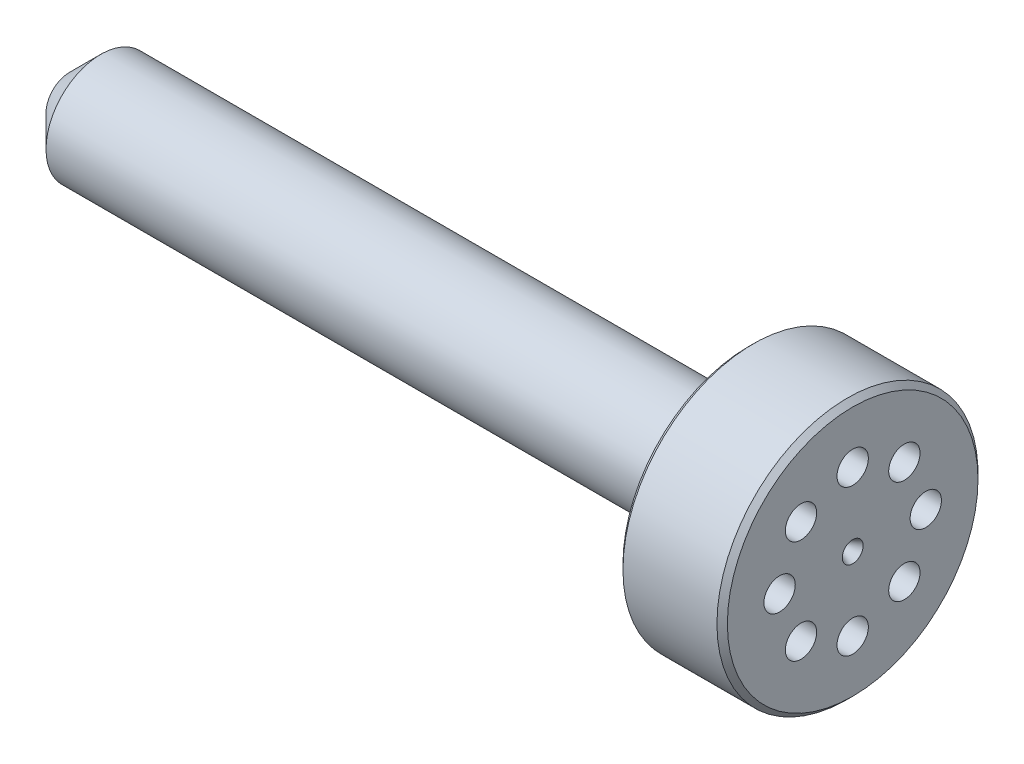
ISO-10303-21;
HEADER;
FILE_DESCRIPTION(('STEP AP214'),'2;1');
FILE_NAME('part.step','',(''),(''),'','','');
FILE_SCHEMA(('AUTOMOTIVE_DESIGN { 1 0 10303 214 1 1 1 1 }'));
ENDSEC;
DATA;
#1=APPLICATION_CONTEXT('core data for automotive mechanical design processes');
#2=APPLICATION_PROTOCOL_DEFINITION('international standard','automotive_design',2000,#1);
#3=PRODUCT_CONTEXT('',#1,'mechanical');
#4=PRODUCT('Part','Part','',(#3));
#5=PRODUCT_RELATED_PRODUCT_CATEGORY('part','',(#4));
#6=PRODUCT_DEFINITION_FORMATION('','',#4);
#7=PRODUCT_DEFINITION_CONTEXT('part definition',#1,'design');
#8=PRODUCT_DEFINITION('design','',#6,#7);
#9=PRODUCT_DEFINITION_SHAPE('','',#8);
#10=(LENGTH_UNIT() NAMED_UNIT(*) SI_UNIT(.MILLI.,.METRE.));
#11=(NAMED_UNIT(*) PLANE_ANGLE_UNIT() SI_UNIT($,.RADIAN.));
#12=(NAMED_UNIT(*) SI_UNIT($,.STERADIAN.) SOLID_ANGLE_UNIT());
#13=UNCERTAINTY_MEASURE_WITH_UNIT(LENGTH_MEASURE(1.E-05),#10,'distance_accuracy_value','');
#14=(GEOMETRIC_REPRESENTATION_CONTEXT(3) GLOBAL_UNCERTAINTY_ASSIGNED_CONTEXT((#13)) GLOBAL_UNIT_ASSIGNED_CONTEXT((#10,
#11,#12)) REPRESENTATION_CONTEXT('',''));
#15=CARTESIAN_POINT('',(0.,0.,0.));
#16=DIRECTION('',(0.,0.,1.));
#17=DIRECTION('',(1.,0.,0.));
#18=AXIS2_PLACEMENT_3D('',#15,#16,#17);
#19=CARTESIAN_POINT('',(-34.,0.,0.));
#20=DIRECTION('',(-1.,0.,0.));
#21=DIRECTION('',(0.,0.,1.));
#22=AXIS2_PLACEMENT_3D('',#19,#20,#21);
#23=CONICAL_SURFACE('',#22,1.,0.463647609000804);
#24=CARTESIAN_POINT('',(-32.,0.,0.));
#25=VERTEX_POINT('',#24);
#26=VERTEX_LOOP('',#25);
#27=FACE_BOUND('',#26,.T.);
#28=CARTESIAN_POINT('',(-34.,0.,0.));
#29=DIRECTION('',(-1.,0.,0.));
#30=DIRECTION('',(0.,0.,1.));
#31=AXIS2_PLACEMENT_3D('',#28,#29,#30);
#32=CIRCLE('',#31,1.);
#33=CARTESIAN_POINT('',(-34.,0.,1.));
#34=VERTEX_POINT('',#33);
#35=EDGE_CURVE('E56',#34,#34,#32,.T.);
#36=ORIENTED_EDGE('',*,*,#35,.T.);
#37=EDGE_LOOP('',(#36));
#38=FACE_BOUND('',#37,.T.);
#39=ADVANCED_FACE('F35',(#27,#38),#23,.F.);
#40=CARTESIAN_POINT('',(-34.,0.,-0.999999999999996));
#41=DIRECTION('',(1.,0.,0.));
#42=DIRECTION('',(0.,0.,-1.));
#43=AXIS2_PLACEMENT_3D('',#40,#41,#42);
#44=PLANE('',#43);
#45=ORIENTED_EDGE('',*,*,#35,.F.);
#46=EDGE_LOOP('',(#45));
#47=FACE_BOUND('',#46,.T.);
#48=CARTESIAN_POINT('',(-34.,0.,0.));
#49=DIRECTION('',(-1.,0.,0.));
#50=DIRECTION('',(0.,0.,1.));
#51=AXIS2_PLACEMENT_3D('',#48,#49,#50);
#52=CIRCLE('',#51,2.25);
#53=CARTESIAN_POINT('',(-34.,0.,2.25));
#54=VERTEX_POINT('',#53);
#55=EDGE_CURVE('E59',#54,#54,#52,.T.);
#56=ORIENTED_EDGE('',*,*,#55,.T.);
#57=EDGE_LOOP('',(#56));
#58=FACE_BOUND('',#57,.T.);
#59=ADVANCED_FACE('F52',(#47,#58),#44,.F.);
#60=CARTESIAN_POINT('',(-31.,0.,0.));
#61=DIRECTION('',(1.,0.,0.));
#62=DIRECTION('',(0.,0.,-1.));
#63=AXIS2_PLACEMENT_3D('',#60,#61,#62);
#64=CONICAL_SURFACE('',#63,5.25,0.785398163397449);
#65=ORIENTED_EDGE('',*,*,#55,.F.);
#66=EDGE_LOOP('',(#65));
#67=FACE_BOUND('',#66,.T.);
#68=CARTESIAN_POINT('',(-31.,0.,0.));
#69=DIRECTION('',(-1.,0.,0.));
#70=DIRECTION('',(0.,0.,1.));
#71=AXIS2_PLACEMENT_3D('',#68,#69,#70);
#72=CIRCLE('',#71,5.25);
#73=CARTESIAN_POINT('',(-31.,0.,5.25000000000001));
#74=VERTEX_POINT('',#73);
#75=EDGE_CURVE('E65',#74,#74,#72,.T.);
#76=ORIENTED_EDGE('',*,*,#75,.T.);
#77=EDGE_LOOP('',(#76));
#78=FACE_BOUND('',#77,.T.);
#79=ADVANCED_FACE('F186',(#67,#78),#64,.T.);
#80=CARTESIAN_POINT('',(-32.,0.,0.));
#81=DIRECTION('',(-1.,0.,0.));
#82=DIRECTION('',(0.,0.,1.));
#83=AXIS2_PLACEMENT_3D('',#80,#81,#82);
#84=CYLINDRICAL_SURFACE('',#83,5.25);
#85=ORIENTED_EDGE('',*,*,#75,.F.);
#86=EDGE_LOOP('',(#85));
#87=FACE_BOUND('',#86,.T.);
#88=CARTESIAN_POINT('',(31.,0.,0.));
#89=DIRECTION('',(-1.,0.,0.));
#90=DIRECTION('',(0.,0.,1.));
#91=AXIS2_PLACEMENT_3D('',#88,#89,#90);
#92=CIRCLE('',#91,5.25000000000001);
#93=CARTESIAN_POINT('',(31.,0.,5.25000000000002));
#94=VERTEX_POINT('',#93);
#95=EDGE_CURVE('E101',#94,#94,#92,.T.);
#96=ORIENTED_EDGE('',*,*,#95,.T.);
#97=EDGE_LOOP('',(#96));
#98=FACE_BOUND('',#97,.T.);
#99=ADVANCED_FACE('F96',(#87,#98),#84,.T.);
#100=CARTESIAN_POINT('',(31.,0.,-5.25));
#101=DIRECTION('',(1.,0.,0.));
#102=DIRECTION('',(0.,0.,-1.));
#103=AXIS2_PLACEMENT_3D('',#100,#101,#102);
#104=PLANE('',#103);
#105=CARTESIAN_POINT('',(31.,4.94974746830583,4.94974746830584));
#106=DIRECTION('',(1.,0.,0.));
#107=DIRECTION('',(0.,0.,-1.));
#108=AXIS2_PLACEMENT_3D('',#105,#106,#107);
#109=CIRCLE('',#108,1.5);
#110=CARTESIAN_POINT('',(31.,4.94974746830583,3.44974746830584));
#111=VERTEX_POINT('',#110);
#112=EDGE_CURVE('E107',#111,#111,#109,.T.);
#113=ORIENTED_EDGE('',*,*,#112,.T.);
#114=EDGE_LOOP('',(#113));
#115=FACE_BOUND('',#114,.T.);
#116=CARTESIAN_POINT('',(31.,0.,7.00000000000001));
#117=DIRECTION('',(1.,0.,0.));
#118=DIRECTION('',(0.,0.,-1.));
#119=AXIS2_PLACEMENT_3D('',#116,#117,#118);
#120=CIRCLE('',#119,1.50000000000009);
#121=CARTESIAN_POINT('',(31.,0.,5.49999999999992));
#122=VERTEX_POINT('',#121);
#123=EDGE_CURVE('E112',#122,#122,#120,.T.);
#124=ORIENTED_EDGE('',*,*,#123,.T.);
#125=EDGE_LOOP('',(#124));
#126=FACE_BOUND('',#125,.T.);
#127=CARTESIAN_POINT('',(31.,-4.94974746830583,4.94974746830584));
#128=DIRECTION('',(1.,0.,0.));
#129=DIRECTION('',(0.,0.,-1.));
#130=AXIS2_PLACEMENT_3D('',#127,#128,#129);
#131=CIRCLE('',#130,1.5);
#132=CARTESIAN_POINT('',(31.,-4.94974746830583,3.44974746830584));
#133=VERTEX_POINT('',#132);
#134=EDGE_CURVE('E115',#133,#133,#131,.T.);
#135=ORIENTED_EDGE('',*,*,#134,.T.);
#136=EDGE_LOOP('',(#135));
#137=FACE_BOUND('',#136,.T.);
#138=CARTESIAN_POINT('',(31.,-7.,0.));
#139=DIRECTION('',(1.,0.,0.));
#140=DIRECTION('',(0.,0.,-1.));
#141=AXIS2_PLACEMENT_3D('',#138,#139,#140);
#142=CIRCLE('',#141,1.5);
#143=CARTESIAN_POINT('',(31.,-7.,-1.49999999999999));
#144=VERTEX_POINT('',#143);
#145=EDGE_CURVE('E118',#144,#144,#142,.T.);
#146=ORIENTED_EDGE('',*,*,#145,.T.);
#147=EDGE_LOOP('',(#146));
#148=FACE_BOUND('',#147,.T.);
#149=CARTESIAN_POINT('',(31.,-4.94974746830583,-4.94974746830583));
#150=DIRECTION('',(1.,0.,0.));
#151=DIRECTION('',(0.,0.,-1.));
#152=AXIS2_PLACEMENT_3D('',#149,#150,#151);
#153=CIRCLE('',#152,1.5);
#154=CARTESIAN_POINT('',(31.,-4.94974746830583,-6.44974746830583));
#155=VERTEX_POINT('',#154);
#156=EDGE_CURVE('E121',#155,#155,#153,.T.);
#157=ORIENTED_EDGE('',*,*,#156,.T.);
#158=EDGE_LOOP('',(#157));
#159=FACE_BOUND('',#158,.T.);
#160=CARTESIAN_POINT('',(31.,0.,-6.99999999999999));
#161=DIRECTION('',(1.,0.,0.));
#162=DIRECTION('',(0.,0.,-1.));
#163=AXIS2_PLACEMENT_3D('',#160,#161,#162);
#164=CIRCLE('',#163,1.50000000000003);
#165=CARTESIAN_POINT('',(31.,0.,-8.50000000000003));
#166=VERTEX_POINT('',#165);
#167=EDGE_CURVE('E124',#166,#166,#164,.T.);
#168=ORIENTED_EDGE('',*,*,#167,.T.);
#169=EDGE_LOOP('',(#168));
#170=FACE_BOUND('',#169,.T.);
#171=CARTESIAN_POINT('',(31.,4.94974746830583,-4.94974746830583));
#172=DIRECTION('',(1.,0.,0.));
#173=DIRECTION('',(0.,0.,-1.));
#174=AXIS2_PLACEMENT_3D('',#171,#172,#173);
#175=CIRCLE('',#174,1.5);
#176=CARTESIAN_POINT('',(31.,4.94974746830583,-6.44974746830583));
#177=VERTEX_POINT('',#176);
#178=EDGE_CURVE('E127',#177,#177,#175,.T.);
#179=ORIENTED_EDGE('',*,*,#178,.T.);
#180=EDGE_LOOP('',(#179));
#181=FACE_BOUND('',#180,.T.);
#182=CARTESIAN_POINT('',(31.,7.,0.));
#183=DIRECTION('',(1.,0.,0.));
#184=DIRECTION('',(0.,0.,-1.));
#185=AXIS2_PLACEMENT_3D('',#182,#183,#184);
#186=CIRCLE('',#185,1.5);
#187=CARTESIAN_POINT('',(31.,7.,-1.5));
#188=VERTEX_POINT('',#187);
#189=EDGE_CURVE('E130',#188,#188,#186,.T.);
#190=ORIENTED_EDGE('',*,*,#189,.T.);
#191=EDGE_LOOP('',(#190));
#192=FACE_BOUND('',#191,.T.);
#193=CARTESIAN_POINT('',(31.,0.,0.));
#194=DIRECTION('',(1.,0.,0.));
#195=DIRECTION('',(0.,0.,-1.));
#196=AXIS2_PLACEMENT_3D('',#193,#194,#195);
#197=CIRCLE('',#196,12.);
#198=CARTESIAN_POINT('',(31.,0.,-12.));
#199=VERTEX_POINT('',#198);
#200=EDGE_CURVE('E11',#199,#199,#197,.F.);
#201=ORIENTED_EDGE('',*,*,#200,.T.);
#202=EDGE_LOOP('',(#201));
#203=FACE_BOUND('',#202,.T.);
#204=ORIENTED_EDGE('',*,*,#95,.F.);
#205=EDGE_LOOP('',(#204));
#206=FACE_BOUND('',#205,.T.);
#207=ADVANCED_FACE('F85',(#115,#126,#137,#148,#159,#170,#181,#192,#203,#206),#104,.F.);
#208=CARTESIAN_POINT('',(-32.,0.,0.));
#209=DIRECTION('',(-1.,0.,0.));
#210=DIRECTION('',(0.,0.,1.));
#211=AXIS2_PLACEMENT_3D('',#208,#209,#210);
#212=CYLINDRICAL_SURFACE('',#211,12.5);
#213=CARTESIAN_POINT('',(40.5,0.,0.));
#214=DIRECTION('',(-1.,0.,0.));
#215=DIRECTION('',(0.,0.,1.));
#216=AXIS2_PLACEMENT_3D('',#213,#214,#215);
#217=CIRCLE('',#216,12.5);
#218=CARTESIAN_POINT('',(40.5,0.,12.5));
#219=VERTEX_POINT('',#218);
#220=EDGE_CURVE('E62',#219,#219,#217,.T.);
#221=ORIENTED_EDGE('',*,*,#220,.T.);
#222=EDGE_LOOP('',(#221));
#223=FACE_BOUND('',#222,.T.);
#224=CARTESIAN_POINT('',(31.5,0.,0.));
#225=DIRECTION('',(1.,0.,0.));
#226=DIRECTION('',(0.,0.,-1.));
#227=AXIS2_PLACEMENT_3D('',#224,#225,#226);
#228=CIRCLE('',#227,12.5);
#229=CARTESIAN_POINT('',(31.5,0.,-12.5));
#230=VERTEX_POINT('',#229);
#231=EDGE_CURVE('E58',#230,#230,#228,.T.);
#232=ORIENTED_EDGE('',*,*,#231,.T.);
#233=EDGE_LOOP('',(#232));
#234=FACE_BOUND('',#233,.T.);
#235=ADVANCED_FACE('F82',(#223,#234),#212,.T.);
#236=CARTESIAN_POINT('',(41.,0.,-12.5));
#237=DIRECTION('',(-1.,0.,0.));
#238=DIRECTION('',(0.,0.,1.));
#239=AXIS2_PLACEMENT_3D('',#236,#237,#238);
#240=PLANE('',#239);
#241=CARTESIAN_POINT('',(41.,4.94974746830583,4.94974746830584));
#242=DIRECTION('',(1.,0.,0.));
#243=DIRECTION('',(0.,0.,-1.));
#244=AXIS2_PLACEMENT_3D('',#241,#242,#243);
#245=CIRCLE('',#244,1.5);
#246=CARTESIAN_POINT('',(41.,4.94974746830583,3.44974746830584));
#247=VERTEX_POINT('',#246);
#248=EDGE_CURVE('E137',#247,#247,#245,.T.);
#249=ORIENTED_EDGE('',*,*,#248,.F.);
#250=EDGE_LOOP('',(#249));
#251=FACE_BOUND('',#250,.T.);
#252=CARTESIAN_POINT('',(41.,0.,7.00000000000001));
#253=DIRECTION('',(1.,0.,0.));
#254=DIRECTION('',(0.,0.,-1.));
#255=AXIS2_PLACEMENT_3D('',#252,#253,#254);
#256=CIRCLE('',#255,1.50000000000009);
#257=CARTESIAN_POINT('',(41.,0.,5.49999999999991));
#258=VERTEX_POINT('',#257);
#259=EDGE_CURVE('E140',#258,#258,#256,.T.);
#260=ORIENTED_EDGE('',*,*,#259,.F.);
#261=EDGE_LOOP('',(#260));
#262=FACE_BOUND('',#261,.T.);
#263=CARTESIAN_POINT('',(41.,-4.94974746830583,4.94974746830584));
#264=DIRECTION('',(1.,0.,0.));
#265=DIRECTION('',(0.,0.,-1.));
#266=AXIS2_PLACEMENT_3D('',#263,#264,#265);
#267=CIRCLE('',#266,1.5);
#268=CARTESIAN_POINT('',(41.,-4.94974746830583,3.44974746830584));
#269=VERTEX_POINT('',#268);
#270=EDGE_CURVE('E143',#269,#269,#267,.T.);
#271=ORIENTED_EDGE('',*,*,#270,.F.);
#272=EDGE_LOOP('',(#271));
#273=FACE_BOUND('',#272,.T.);
#274=CARTESIAN_POINT('',(41.,-7.,0.));
#275=DIRECTION('',(1.,0.,0.));
#276=DIRECTION('',(0.,0.,-1.));
#277=AXIS2_PLACEMENT_3D('',#274,#275,#276);
#278=CIRCLE('',#277,1.5);
#279=CARTESIAN_POINT('',(41.,-7.,-1.49999999999999));
#280=VERTEX_POINT('',#279);
#281=EDGE_CURVE('E146',#280,#280,#278,.T.);
#282=ORIENTED_EDGE('',*,*,#281,.F.);
#283=EDGE_LOOP('',(#282));
#284=FACE_BOUND('',#283,.T.);
#285=CARTESIAN_POINT('',(41.,-4.94974746830583,-4.94974746830583));
#286=DIRECTION('',(1.,0.,0.));
#287=DIRECTION('',(0.,0.,-1.));
#288=AXIS2_PLACEMENT_3D('',#285,#286,#287);
#289=CIRCLE('',#288,1.5);
#290=CARTESIAN_POINT('',(41.,-4.94974746830583,-6.44974746830583));
#291=VERTEX_POINT('',#290);
#292=EDGE_CURVE('E149',#291,#291,#289,.T.);
#293=ORIENTED_EDGE('',*,*,#292,.F.);
#294=EDGE_LOOP('',(#293));
#295=FACE_BOUND('',#294,.T.);
#296=CARTESIAN_POINT('',(41.,0.,-6.99999999999999));
#297=DIRECTION('',(1.,0.,0.));
#298=DIRECTION('',(0.,0.,-1.));
#299=AXIS2_PLACEMENT_3D('',#296,#297,#298);
#300=CIRCLE('',#299,1.50000000000003);
#301=CARTESIAN_POINT('',(41.,0.,-8.50000000000003));
#302=VERTEX_POINT('',#301);
#303=EDGE_CURVE('E152',#302,#302,#300,.T.);
#304=ORIENTED_EDGE('',*,*,#303,.F.);
#305=EDGE_LOOP('',(#304));
#306=FACE_BOUND('',#305,.T.);
#307=CARTESIAN_POINT('',(41.,4.94974746830583,-4.94974746830583));
#308=DIRECTION('',(1.,0.,0.));
#309=DIRECTION('',(0.,0.,-1.));
#310=AXIS2_PLACEMENT_3D('',#307,#308,#309);
#311=CIRCLE('',#310,1.5);
#312=CARTESIAN_POINT('',(41.,4.94974746830583,-6.44974746830583));
#313=VERTEX_POINT('',#312);
#314=EDGE_CURVE('E136',#313,#313,#311,.T.);
#315=ORIENTED_EDGE('',*,*,#314,.F.);
#316=EDGE_LOOP('',(#315));
#317=FACE_BOUND('',#316,.T.);
#318=CARTESIAN_POINT('',(41.,7.,0.));
#319=DIRECTION('',(1.,0.,0.));
#320=DIRECTION('',(0.,0.,-1.));
#321=AXIS2_PLACEMENT_3D('',#318,#319,#320);
#322=CIRCLE('',#321,1.5);
#323=CARTESIAN_POINT('',(41.,7.,-1.5));
#324=VERTEX_POINT('',#323);
#325=EDGE_CURVE('E133',#324,#324,#322,.T.);
#326=ORIENTED_EDGE('',*,*,#325,.F.);
#327=EDGE_LOOP('',(#326));
#328=FACE_BOUND('',#327,.T.);
#329=CARTESIAN_POINT('',(41.,0.,0.));
#330=DIRECTION('',(-1.,0.,0.));
#331=DIRECTION('',(0.,0.,1.));
#332=AXIS2_PLACEMENT_3D('',#329,#330,#331);
#333=CIRCLE('',#332,12.);
#334=CARTESIAN_POINT('',(41.,0.,12.));
#335=VERTEX_POINT('',#334);
#336=EDGE_CURVE('E44',#335,#335,#333,.F.);
#337=ORIENTED_EDGE('',*,*,#336,.T.);
#338=EDGE_LOOP('',(#337));
#339=FACE_BOUND('',#338,.T.);
#340=CARTESIAN_POINT('',(41.,0.,0.));
#341=DIRECTION('',(-1.,0.,0.));
#342=DIRECTION('',(0.,0.,1.));
#343=AXIS2_PLACEMENT_3D('',#340,#341,#342);
#344=CIRCLE('',#343,1.00000000000001);
#345=CARTESIAN_POINT('',(41.,0.,1.00000000000002));
#346=VERTEX_POINT('',#345);
#347=EDGE_CURVE('E103',#346,#346,#344,.T.);
#348=ORIENTED_EDGE('',*,*,#347,.T.);
#349=EDGE_LOOP('',(#348));
#350=FACE_BOUND('',#349,.T.);
#351=ADVANCED_FACE('F73',(#251,#262,#273,#284,#295,#306,#317,#328,#339,#350),#240,.F.);
#352=CARTESIAN_POINT('',(39.,0.,0.));
#353=DIRECTION('',(1.,0.,0.));
#354=DIRECTION('',(0.,0.,-1.));
#355=AXIS2_PLACEMENT_3D('',#352,#353,#354);
#356=CONICAL_SURFACE('',#355,0.,0.463647609000812);
#357=ORIENTED_EDGE('',*,*,#347,.F.);
#358=EDGE_LOOP('',(#357));
#359=FACE_BOUND('',#358,.T.);
#360=CARTESIAN_POINT('',(39.,0.,0.));
#361=VERTEX_POINT('',#360);
#362=VERTEX_LOOP('',#361);
#363=FACE_BOUND('',#362,.T.);
#364=ADVANCED_FACE('F79',(#359,#363),#356,.F.);
#365=CARTESIAN_POINT('',(40.5,0.,0.));
#366=DIRECTION('',(-1.,0.,0.));
#367=DIRECTION('',(0.,0.,1.));
#368=AXIS2_PLACEMENT_3D('',#365,#366,#367);
#369=CONICAL_SURFACE('',#368,12.5,0.785398163397436);
#370=ORIENTED_EDGE('',*,*,#336,.F.);
#371=EDGE_LOOP('',(#370));
#372=FACE_BOUND('',#371,.T.);
#373=ORIENTED_EDGE('',*,*,#220,.F.);
#374=EDGE_LOOP('',(#373));
#375=FACE_BOUND('',#374,.T.);
#376=ADVANCED_FACE('F76',(#372,#375),#369,.T.);
#377=CARTESIAN_POINT('',(31.,0.,0.));
#378=DIRECTION('',(1.,0.,0.));
#379=DIRECTION('',(0.,0.,-1.));
#380=AXIS2_PLACEMENT_3D('',#377,#378,#379);
#381=CONICAL_SURFACE('',#380,12.,0.785398163397443);
#382=ORIENTED_EDGE('',*,*,#231,.F.);
#383=EDGE_LOOP('',(#382));
#384=FACE_BOUND('',#383,.T.);
#385=ORIENTED_EDGE('',*,*,#200,.F.);
#386=EDGE_LOOP('',(#385));
#387=FACE_BOUND('',#386,.T.);
#388=ADVANCED_FACE('F38',(#384,#387),#381,.T.);
#389=CARTESIAN_POINT('',(-34.,7.,0.));
#390=DIRECTION('',(1.,0.,0.));
#391=DIRECTION('',(0.,0.,-1.));
#392=AXIS2_PLACEMENT_3D('',#389,#390,#391);
#393=CYLINDRICAL_SURFACE('',#392,1.5);
#394=ORIENTED_EDGE('',*,*,#325,.T.);
#395=EDGE_LOOP('',(#394));
#396=FACE_BOUND('',#395,.T.);
#397=ORIENTED_EDGE('',*,*,#189,.F.);
#398=EDGE_LOOP('',(#397));
#399=FACE_BOUND('',#398,.T.);
#400=ADVANCED_FACE('F91',(#396,#399),#393,.F.);
#401=CARTESIAN_POINT('',(-34.,4.94974746830583,-4.94974746830582));
#402=DIRECTION('',(1.,0.,0.));
#403=DIRECTION('',(0.,0.,-1.));
#404=AXIS2_PLACEMENT_3D('',#401,#402,#403);
#405=CYLINDRICAL_SURFACE('',#404,1.5);
#406=ORIENTED_EDGE('',*,*,#314,.T.);
#407=EDGE_LOOP('',(#406));
#408=FACE_BOUND('',#407,.T.);
#409=ORIENTED_EDGE('',*,*,#178,.F.);
#410=EDGE_LOOP('',(#409));
#411=FACE_BOUND('',#410,.T.);
#412=ADVANCED_FACE('F158',(#408,#411),#405,.F.);
#413=CARTESIAN_POINT('',(-34.,0.,-6.99999999999999));
#414=DIRECTION('',(1.,0.,0.));
#415=DIRECTION('',(0.,0.,-1.));
#416=AXIS2_PLACEMENT_3D('',#413,#414,#415);
#417=CYLINDRICAL_SURFACE('',#416,1.50000000000003);
#418=ORIENTED_EDGE('',*,*,#303,.T.);
#419=EDGE_LOOP('',(#418));
#420=FACE_BOUND('',#419,.T.);
#421=ORIENTED_EDGE('',*,*,#167,.F.);
#422=EDGE_LOOP('',(#421));
#423=FACE_BOUND('',#422,.T.);
#424=ADVANCED_FACE('F175',(#420,#423),#417,.F.);
#425=CARTESIAN_POINT('',(-34.,-4.94974746830583,-4.94974746830582));
#426=DIRECTION('',(1.,0.,0.));
#427=DIRECTION('',(0.,0.,-1.));
#428=AXIS2_PLACEMENT_3D('',#425,#426,#427);
#429=CYLINDRICAL_SURFACE('',#428,1.5);
#430=ORIENTED_EDGE('',*,*,#292,.T.);
#431=EDGE_LOOP('',(#430));
#432=FACE_BOUND('',#431,.T.);
#433=ORIENTED_EDGE('',*,*,#156,.F.);
#434=EDGE_LOOP('',(#433));
#435=FACE_BOUND('',#434,.T.);
#436=ADVANCED_FACE('F258',(#432,#435),#429,.F.);
#437=CARTESIAN_POINT('',(-34.,-7.,0.));
#438=DIRECTION('',(1.,0.,0.));
#439=DIRECTION('',(0.,0.,-1.));
#440=AXIS2_PLACEMENT_3D('',#437,#438,#439);
#441=CYLINDRICAL_SURFACE('',#440,1.5);
#442=ORIENTED_EDGE('',*,*,#281,.T.);
#443=EDGE_LOOP('',(#442));
#444=FACE_BOUND('',#443,.T.);
#445=ORIENTED_EDGE('',*,*,#145,.F.);
#446=EDGE_LOOP('',(#445));
#447=FACE_BOUND('',#446,.T.);
#448=ADVANCED_FACE('F267',(#444,#447),#441,.F.);
#449=CARTESIAN_POINT('',(-34.,-4.94974746830583,4.94974746830584));
#450=DIRECTION('',(1.,0.,0.));
#451=DIRECTION('',(0.,0.,-1.));
#452=AXIS2_PLACEMENT_3D('',#449,#450,#451);
#453=CYLINDRICAL_SURFACE('',#452,1.5);
#454=ORIENTED_EDGE('',*,*,#270,.T.);
#455=EDGE_LOOP('',(#454));
#456=FACE_BOUND('',#455,.T.);
#457=ORIENTED_EDGE('',*,*,#134,.F.);
#458=EDGE_LOOP('',(#457));
#459=FACE_BOUND('',#458,.T.);
#460=ADVANCED_FACE('F276',(#456,#459),#453,.F.);
#461=CARTESIAN_POINT('',(-34.,0.,7.00000000000001));
#462=DIRECTION('',(1.,0.,0.));
#463=DIRECTION('',(0.,0.,-1.));
#464=AXIS2_PLACEMENT_3D('',#461,#462,#463);
#465=CYLINDRICAL_SURFACE('',#464,1.50000000000009);
#466=ORIENTED_EDGE('',*,*,#259,.T.);
#467=EDGE_LOOP('',(#466));
#468=FACE_BOUND('',#467,.T.);
#469=ORIENTED_EDGE('',*,*,#123,.F.);
#470=EDGE_LOOP('',(#469));
#471=FACE_BOUND('',#470,.T.);
#472=ADVANCED_FACE('F285',(#468,#471),#465,.F.);
#473=CARTESIAN_POINT('',(-34.,4.94974746830583,4.94974746830584));
#474=DIRECTION('',(1.,0.,0.));
#475=DIRECTION('',(0.,0.,-1.));
#476=AXIS2_PLACEMENT_3D('',#473,#474,#475);
#477=CYLINDRICAL_SURFACE('',#476,1.5);
#478=ORIENTED_EDGE('',*,*,#248,.T.);
#479=EDGE_LOOP('',(#478));
#480=FACE_BOUND('',#479,.T.);
#481=ORIENTED_EDGE('',*,*,#112,.F.);
#482=EDGE_LOOP('',(#481));
#483=FACE_BOUND('',#482,.T.);
#484=ADVANCED_FACE('F179',(#480,#483),#477,.F.);
#485=CLOSED_SHELL('',(#39,#59,#79,#99,#207,#235,#351,#364,#376,#388,#400,#412,#424,#436,#448,
#460,#472,#484));
#486=MANIFOLD_SOLID_BREP('B2',#485);
#487=ADVANCED_BREP_SHAPE_REPRESENTATION('',(#18,#486),#14);
#488=SHAPE_DEFINITION_REPRESENTATION(#9,#487);
ENDSEC;
END-ISO-10303-21;
